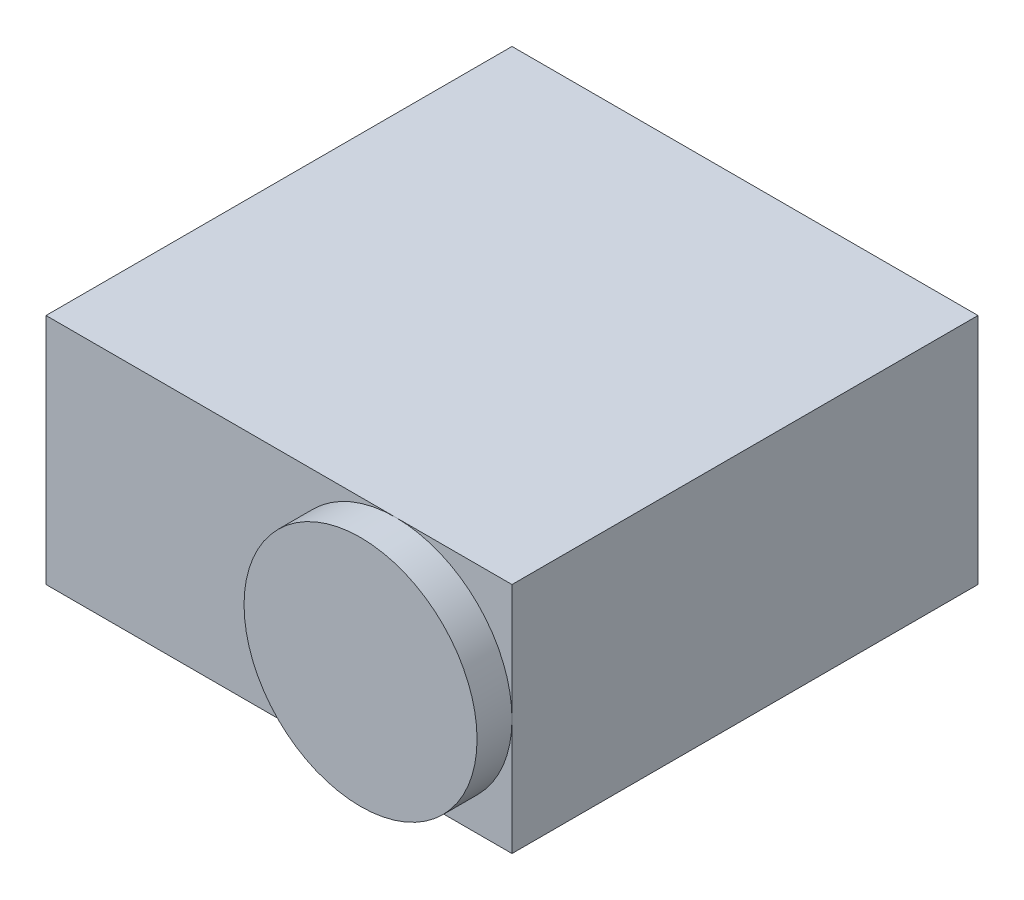
ISO-10303-21;
HEADER;
FILE_DESCRIPTION(('STEP AP214'),'2;1');
FILE_NAME('part.step','',(''),(''),'','','');
FILE_SCHEMA(('AUTOMOTIVE_DESIGN { 1 0 10303 214 1 1 1 1 }'));
ENDSEC;
DATA;
#1=APPLICATION_CONTEXT('core data for automotive mechanical design processes');
#2=APPLICATION_PROTOCOL_DEFINITION('international standard','automotive_design',2000,#1);
#3=PRODUCT_CONTEXT('',#1,'mechanical');
#4=PRODUCT('Part','Part','',(#3));
#5=PRODUCT_RELATED_PRODUCT_CATEGORY('part','',(#4));
#6=PRODUCT_DEFINITION_FORMATION('','',#4);
#7=PRODUCT_DEFINITION_CONTEXT('part definition',#1,'design');
#8=PRODUCT_DEFINITION('design','',#6,#7);
#9=PRODUCT_DEFINITION_SHAPE('','',#8);
#10=(LENGTH_UNIT() NAMED_UNIT(*) SI_UNIT(.MILLI.,.METRE.));
#11=(NAMED_UNIT(*) PLANE_ANGLE_UNIT() SI_UNIT($,.RADIAN.));
#12=(NAMED_UNIT(*) SI_UNIT($,.STERADIAN.) SOLID_ANGLE_UNIT());
#13=UNCERTAINTY_MEASURE_WITH_UNIT(LENGTH_MEASURE(1.E-05),#10,'distance_accuracy_value','');
#14=(GEOMETRIC_REPRESENTATION_CONTEXT(3) GLOBAL_UNCERTAINTY_ASSIGNED_CONTEXT((#13)) GLOBAL_UNIT_ASSIGNED_CONTEXT((#10,
#11,#12)) REPRESENTATION_CONTEXT('',''));
#15=CARTESIAN_POINT('',(0.,0.,0.));
#16=DIRECTION('',(0.,0.,1.));
#17=DIRECTION('',(1.,0.,0.));
#18=AXIS2_PLACEMENT_3D('',#15,#16,#17);
#19=CARTESIAN_POINT('',(0.,20.,0.));
#20=DIRECTION('',(0.,0.,-1.));
#21=DIRECTION('',(-1.,0.,0.));
#22=AXIS2_PLACEMENT_3D('',#19,#20,#21);
#23=PLANE('',#22);
#24=CARTESIAN_POINT('',(30.,10.,0.));
#25=DIRECTION('',(0.,0.,1.));
#26=DIRECTION('',(1.,0.,0.));
#27=AXIS2_PLACEMENT_3D('',#24,#25,#26);
#28=CIRCLE('',#27,10.);
#29=CARTESIAN_POINT('',(40.,10.,0.));
#30=VERTEX_POINT('',#29);
#31=CARTESIAN_POINT('',(30.,20.,0.));
#32=VERTEX_POINT('',#31);
#33=EDGE_CURVE('E44',#30,#32,#28,.T.);
#34=ORIENTED_EDGE('',*,*,#33,.F.);
#35=DIRECTION('',(0.,-1.,0.));
#36=VECTOR('',#35,1.);
#37=CARTESIAN_POINT('',(40.,20.,0.));
#38=LINE('',#37,#36);
#39=CARTESIAN_POINT('',(40.,20.,0.));
#40=VERTEX_POINT('',#39);
#41=EDGE_CURVE('E86',#40,#30,#38,.T.);
#42=ORIENTED_EDGE('',*,*,#41,.F.);
#43=DIRECTION('',(1.,0.,0.));
#44=VECTOR('',#43,1.);
#45=CARTESIAN_POINT('',(0.,20.,0.));
#46=LINE('',#45,#44);
#47=EDGE_CURVE('E98',#32,#40,#46,.T.);
#48=ORIENTED_EDGE('',*,*,#47,.F.);
#49=EDGE_LOOP('',(#34,#42,#48));
#50=FACE_BOUND('',#49,.T.);
#51=ADVANCED_FACE('F33',(#50),#23,.F.);
#52=CARTESIAN_POINT('',(30.,0.,0.));
#53=VERTEX_POINT('',#52);
#54=EDGE_CURVE('E11',#32,#53,#28,.T.);
#55=ORIENTED_EDGE('',*,*,#54,.F.);
#56=CARTESIAN_POINT('',(0.,20.,0.));
#57=VERTEX_POINT('',#56);
#58=EDGE_CURVE('E110',#57,#32,#46,.T.);
#59=ORIENTED_EDGE('',*,*,#58,.F.);
#60=DIRECTION('',(0.,-1.,0.));
#61=VECTOR('',#60,1.);
#62=CARTESIAN_POINT('',(0.,20.,0.));
#63=LINE('',#62,#61);
#64=CARTESIAN_POINT('',(0.,0.,0.));
#65=VERTEX_POINT('',#64);
#66=EDGE_CURVE('E37',#57,#65,#63,.T.);
#67=ORIENTED_EDGE('',*,*,#66,.T.);
#68=DIRECTION('',(1.,0.,0.));
#69=VECTOR('',#68,1.);
#70=CARTESIAN_POINT('',(0.,0.,0.));
#71=LINE('',#70,#69);
#72=EDGE_CURVE('E119',#65,#53,#71,.T.);
#73=ORIENTED_EDGE('',*,*,#72,.T.);
#74=EDGE_LOOP('',(#55,#59,#67,#73));
#75=FACE_BOUND('',#74,.T.);
#76=ADVANCED_FACE('F140',(#75),#23,.F.);
#77=CARTESIAN_POINT('',(0.,20.,0.));
#78=DIRECTION('',(1.,0.,0.));
#79=DIRECTION('',(0.,0.,-1.));
#80=AXIS2_PLACEMENT_3D('',#77,#78,#79);
#81=PLANE('',#80);
#82=DIRECTION('',(0.,0.,1.));
#83=VECTOR('',#82,1.);
#84=CARTESIAN_POINT('',(0.,0.,0.));
#85=LINE('',#84,#83);
#86=CARTESIAN_POINT('',(0.,0.,-40.));
#87=VERTEX_POINT('',#86);
#88=EDGE_CURVE('E116',#87,#65,#85,.T.);
#89=ORIENTED_EDGE('',*,*,#88,.T.);
#90=ORIENTED_EDGE('',*,*,#66,.F.);
#91=DIRECTION('',(0.,0.,1.));
#92=VECTOR('',#91,1.);
#93=CARTESIAN_POINT('',(0.,20.,0.));
#94=LINE('',#93,#92);
#95=CARTESIAN_POINT('',(0.,20.,-40.));
#96=VERTEX_POINT('',#95);
#97=EDGE_CURVE('E106',#96,#57,#94,.T.);
#98=ORIENTED_EDGE('',*,*,#97,.F.);
#99=DIRECTION('',(0.,-1.,0.));
#100=VECTOR('',#99,1.);
#101=CARTESIAN_POINT('',(0.,20.,-40.));
#102=LINE('',#101,#100);
#103=EDGE_CURVE('E115',#96,#87,#102,.T.);
#104=ORIENTED_EDGE('',*,*,#103,.T.);
#105=EDGE_LOOP('',(#89,#90,#98,#104));
#106=FACE_BOUND('',#105,.T.);
#107=ADVANCED_FACE('F35',(#106),#81,.F.);
#108=EDGE_CURVE('E42',#53,#30,#28,.T.);
#109=ORIENTED_EDGE('',*,*,#108,.F.);
#110=CARTESIAN_POINT('',(40.,0.,0.));
#111=VERTEX_POINT('',#110);
#112=EDGE_CURVE('E94',#53,#111,#71,.T.);
#113=ORIENTED_EDGE('',*,*,#112,.T.);
#114=EDGE_CURVE('E88',#30,#111,#38,.T.);
#115=ORIENTED_EDGE('',*,*,#114,.F.);
#116=EDGE_LOOP('',(#109,#113,#115));
#117=FACE_BOUND('',#116,.T.);
#118=ADVANCED_FACE('F93',(#117),#23,.F.);
#119=CARTESIAN_POINT('',(40.,20.,0.));
#120=DIRECTION('',(-1.,0.,0.));
#121=DIRECTION('',(0.,0.,1.));
#122=AXIS2_PLACEMENT_3D('',#119,#120,#121);
#123=PLANE('',#122);
#124=DIRECTION('',(0.,0.,-1.));
#125=VECTOR('',#124,1.);
#126=CARTESIAN_POINT('',(40.,0.,0.));
#127=LINE('',#126,#125);
#128=CARTESIAN_POINT('',(40.,0.,-40.));
#129=VERTEX_POINT('',#128);
#130=EDGE_CURVE('E121',#111,#129,#127,.T.);
#131=ORIENTED_EDGE('',*,*,#130,.T.);
#132=DIRECTION('',(0.,-1.,0.));
#133=VECTOR('',#132,1.);
#134=CARTESIAN_POINT('',(40.,20.,-40.));
#135=LINE('',#134,#133);
#136=CARTESIAN_POINT('',(40.,20.,-40.));
#137=VERTEX_POINT('',#136);
#138=EDGE_CURVE('E96',#137,#129,#135,.T.);
#139=ORIENTED_EDGE('',*,*,#138,.F.);
#140=DIRECTION('',(0.,0.,-1.));
#141=VECTOR('',#140,1.);
#142=CARTESIAN_POINT('',(40.,20.,0.));
#143=LINE('',#142,#141);
#144=EDGE_CURVE('E90',#40,#137,#143,.T.);
#145=ORIENTED_EDGE('',*,*,#144,.F.);
#146=ORIENTED_EDGE('',*,*,#41,.T.);
#147=ORIENTED_EDGE('',*,*,#114,.T.);
#148=EDGE_LOOP('',(#131,#139,#145,#146,#147));
#149=FACE_BOUND('',#148,.T.);
#150=ADVANCED_FACE('F87',(#149),#123,.F.);
#151=CARTESIAN_POINT('',(0.,20.,-40.));
#152=DIRECTION('',(0.,0.,1.));
#153=DIRECTION('',(1.,0.,0.));
#154=AXIS2_PLACEMENT_3D('',#151,#152,#153);
#155=PLANE('',#154);
#156=DIRECTION('',(-1.,0.,0.));
#157=VECTOR('',#156,1.);
#158=CARTESIAN_POINT('',(0.,0.,-40.));
#159=LINE('',#158,#157);
#160=EDGE_CURVE('E109',#129,#87,#159,.T.);
#161=ORIENTED_EDGE('',*,*,#160,.T.);
#162=ORIENTED_EDGE('',*,*,#103,.F.);
#163=DIRECTION('',(-1.,0.,0.));
#164=VECTOR('',#163,1.);
#165=CARTESIAN_POINT('',(0.,20.,-40.));
#166=LINE('',#165,#164);
#167=EDGE_CURVE('E113',#137,#96,#166,.T.);
#168=ORIENTED_EDGE('',*,*,#167,.F.);
#169=ORIENTED_EDGE('',*,*,#138,.T.);
#170=EDGE_LOOP('',(#161,#162,#168,#169));
#171=FACE_BOUND('',#170,.T.);
#172=ADVANCED_FACE('F130',(#171),#155,.F.);
#173=CARTESIAN_POINT('',(0.,20.,0.));
#174=DIRECTION('',(0.,-1.,0.));
#175=DIRECTION('',(0.,0.,-1.));
#176=AXIS2_PLACEMENT_3D('',#173,#174,#175);
#177=PLANE('',#176);
#178=ORIENTED_EDGE('',*,*,#97,.T.);
#179=ORIENTED_EDGE('',*,*,#58,.T.);
#180=ORIENTED_EDGE('',*,*,#47,.T.);
#181=ORIENTED_EDGE('',*,*,#144,.T.);
#182=ORIENTED_EDGE('',*,*,#167,.T.);
#183=EDGE_LOOP('',(#178,#179,#180,#181,#182));
#184=FACE_BOUND('',#183,.T.);
#185=ADVANCED_FACE('F139',(#184),#177,.F.);
#186=CARTESIAN_POINT('',(0.,0.,0.));
#187=DIRECTION('',(0.,-1.,0.));
#188=DIRECTION('',(0.,0.,-1.));
#189=AXIS2_PLACEMENT_3D('',#186,#187,#188);
#190=PLANE('',#189);
#191=ORIENTED_EDGE('',*,*,#88,.F.);
#192=ORIENTED_EDGE('',*,*,#160,.F.);
#193=ORIENTED_EDGE('',*,*,#130,.F.);
#194=ORIENTED_EDGE('',*,*,#112,.F.);
#195=ORIENTED_EDGE('',*,*,#72,.F.);
#196=EDGE_LOOP('',(#191,#192,#193,#194,#195));
#197=FACE_BOUND('',#196,.T.);
#198=ADVANCED_FACE('F134',(#197),#190,.T.);
#199=CARTESIAN_POINT('',(30.,10.,3.));
#200=DIRECTION('',(0.,0.,-1.));
#201=DIRECTION('',(-1.,0.,0.));
#202=AXIS2_PLACEMENT_3D('',#199,#200,#201);
#203=CYLINDRICAL_SURFACE('',#202,10.);
#204=CARTESIAN_POINT('',(30.,10.,3.));
#205=DIRECTION('',(0.,0.,1.));
#206=DIRECTION('',(1.,0.,0.));
#207=AXIS2_PLACEMENT_3D('',#204,#205,#206);
#208=CIRCLE('',#207,10.);
#209=CARTESIAN_POINT('',(40.,10.,3.));
#210=VERTEX_POINT('',#209);
#211=EDGE_CURVE('E101',#210,#210,#208,.T.);
#212=ORIENTED_EDGE('',*,*,#211,.F.);
#213=EDGE_LOOP('',(#212));
#214=FACE_BOUND('',#213,.T.);
#215=ORIENTED_EDGE('',*,*,#33,.T.);
#216=ORIENTED_EDGE('',*,*,#54,.T.);
#217=ORIENTED_EDGE('',*,*,#108,.T.);
#218=EDGE_LOOP('',(#215,#216,#217));
#219=FACE_BOUND('',#218,.T.);
#220=ADVANCED_FACE('F102',(#214,#219),#203,.T.);
#221=CARTESIAN_POINT('',(30.,10.,3.));
#222=DIRECTION('',(0.,0.,1.));
#223=DIRECTION('',(1.,0.,0.));
#224=AXIS2_PLACEMENT_3D('',#221,#222,#223);
#225=PLANE('',#224);
#226=ORIENTED_EDGE('',*,*,#211,.T.);
#227=EDGE_LOOP('',(#226));
#228=FACE_BOUND('',#227,.T.);
#229=ADVANCED_FACE('F162',(#228),#225,.T.);
#230=CLOSED_SHELL('',(#51,#76,#107,#118,#150,#172,#185,#198,#220,#229));
#231=MANIFOLD_SOLID_BREP('B2',#230);
#232=ADVANCED_BREP_SHAPE_REPRESENTATION('',(#18,#231),#14);
#233=SHAPE_DEFINITION_REPRESENTATION(#9,#232);
ENDSEC;
END-ISO-10303-21;
